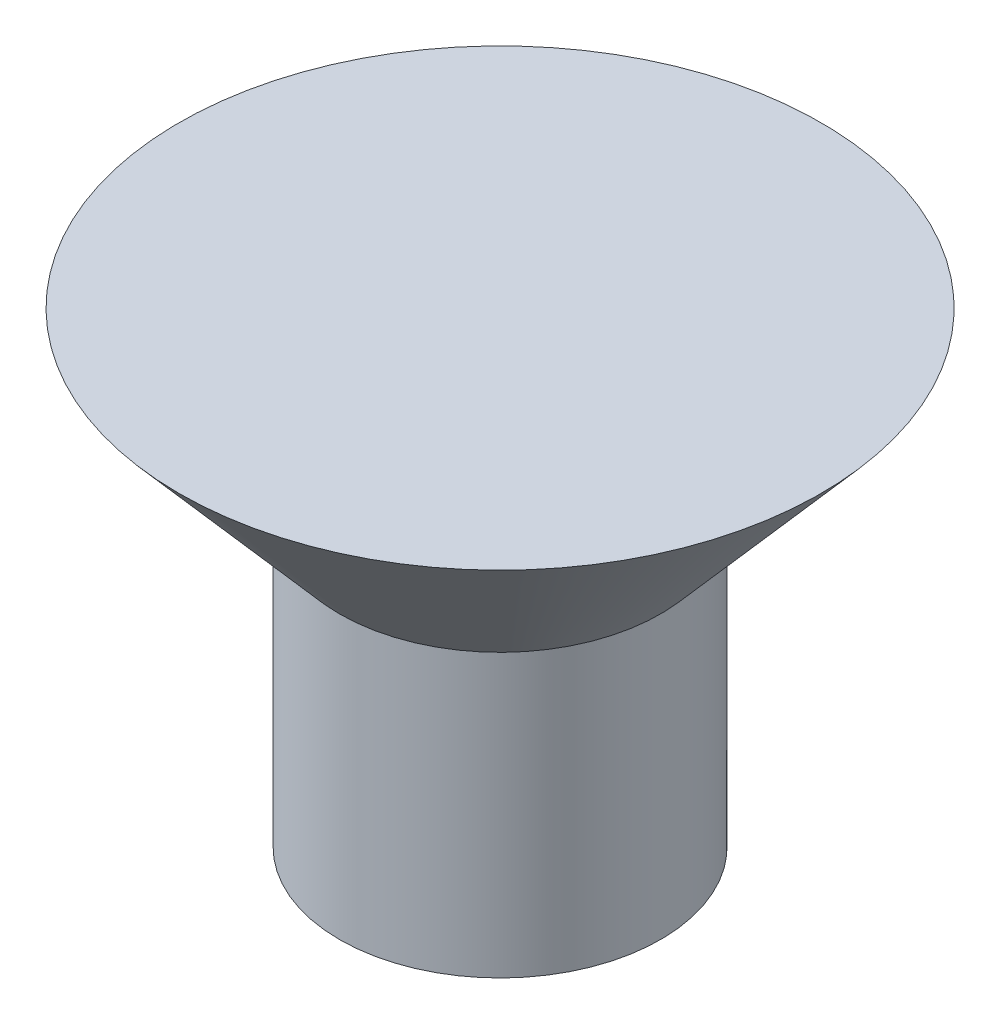
ISO-10303-21;
HEADER;
FILE_DESCRIPTION(('STEP AP214'),'2;1');
FILE_NAME('part.step','',(''),(''),'','','');
FILE_SCHEMA(('AUTOMOTIVE_DESIGN { 1 0 10303 214 1 1 1 1 }'));
ENDSEC;
DATA;
#1=APPLICATION_CONTEXT('core data for automotive mechanical design processes');
#2=APPLICATION_PROTOCOL_DEFINITION('international standard','automotive_design',2000,#1);
#3=PRODUCT_CONTEXT('',#1,'mechanical');
#4=PRODUCT('Part','Part','',(#3));
#5=PRODUCT_RELATED_PRODUCT_CATEGORY('part','',(#4));
#6=PRODUCT_DEFINITION_FORMATION('','',#4);
#7=PRODUCT_DEFINITION_CONTEXT('part definition',#1,'design');
#8=PRODUCT_DEFINITION('design','',#6,#7);
#9=PRODUCT_DEFINITION_SHAPE('','',#8);
#10=(LENGTH_UNIT() NAMED_UNIT(*) SI_UNIT(.MILLI.,.METRE.));
#11=(NAMED_UNIT(*) PLANE_ANGLE_UNIT() SI_UNIT($,.RADIAN.));
#12=(NAMED_UNIT(*) SI_UNIT($,.STERADIAN.) SOLID_ANGLE_UNIT());
#13=UNCERTAINTY_MEASURE_WITH_UNIT(LENGTH_MEASURE(1.E-05),#10,'distance_accuracy_value','');
#14=(GEOMETRIC_REPRESENTATION_CONTEXT(3) GLOBAL_UNCERTAINTY_ASSIGNED_CONTEXT((#13)) GLOBAL_UNIT_ASSIGNED_CONTEXT((#10,
#11,#12)) REPRESENTATION_CONTEXT('',''));
#15=CARTESIAN_POINT('',(0.,0.,0.));
#16=DIRECTION('',(0.,0.,1.));
#17=DIRECTION('',(1.,0.,0.));
#18=AXIS2_PLACEMENT_3D('',#15,#16,#17);
#19=CARTESIAN_POINT('',(0.,0.,0.));
#20=DIRECTION('',(0.,-1.,0.));
#21=DIRECTION('',(0.,0.,-1.));
#22=AXIS2_PLACEMENT_3D('',#19,#20,#21);
#23=PLANE('',#22);
#24=CARTESIAN_POINT('',(0.,0.,0.));
#25=DIRECTION('',(0.,1.,0.));
#26=DIRECTION('',(0.,0.,1.));
#27=AXIS2_PLACEMENT_3D('',#24,#25,#26);
#28=CIRCLE('',#27,2.1844);
#29=CARTESIAN_POINT('',(0.,0.,2.18439999999999));
#30=VERTEX_POINT('',#29);
#31=EDGE_CURVE('E10',#30,#30,#28,.T.);
#32=ORIENTED_EDGE('',*,*,#31,.T.);
#33=EDGE_LOOP('',(#32));
#34=FACE_BOUND('',#33,.T.);
#35=ADVANCED_FACE('F31',(#34),#23,.F.);
#36=CARTESIAN_POINT('',(0.,-1.25643237436678,0.));
#37=DIRECTION('',(0.,1.,0.));
#38=DIRECTION('',(0.,0.,1.));
#39=AXIS2_PLACEMENT_3D('',#36,#37,#38);
#40=CONICAL_SURFACE('',#39,1.0922,0.715584993317677);
#41=ORIENTED_EDGE('',*,*,#31,.F.);
#42=EDGE_LOOP('',(#41));
#43=FACE_BOUND('',#42,.T.);
#44=CARTESIAN_POINT('',(0.,-1.25643237436678,0.));
#45=DIRECTION('',(0.,1.,0.));
#46=DIRECTION('',(0.,0.,1.));
#47=AXIS2_PLACEMENT_3D('',#44,#45,#46);
#48=CIRCLE('',#47,1.0922);
#49=CARTESIAN_POINT('',(0.,-1.25643237436678,1.09219999999999));
#50=VERTEX_POINT('',#49);
#51=EDGE_CURVE('E37',#50,#50,#48,.T.);
#52=ORIENTED_EDGE('',*,*,#51,.T.);
#53=EDGE_LOOP('',(#52));
#54=FACE_BOUND('',#53,.T.);
#55=ADVANCED_FACE('F56',(#43,#54),#40,.T.);
#56=CARTESIAN_POINT('',(0.,42.9850411297935,0.));
#57=DIRECTION('',(0.,1.,0.));
#58=DIRECTION('',(0.,0.,1.));
#59=AXIS2_PLACEMENT_3D('',#56,#57,#58);
#60=CYLINDRICAL_SURFACE('',#59,1.0922);
#61=ORIENTED_EDGE('',*,*,#51,.F.);
#62=EDGE_LOOP('',(#61));
#63=FACE_BOUND('',#62,.T.);
#64=CARTESIAN_POINT('',(0.,-3.175,0.));
#65=DIRECTION('',(0.,1.,0.));
#66=DIRECTION('',(0.,0.,1.));
#67=AXIS2_PLACEMENT_3D('',#64,#65,#66);
#68=CIRCLE('',#67,1.0922);
#69=CARTESIAN_POINT('',(0.,-3.175,1.09219999999999));
#70=VERTEX_POINT('',#69);
#71=EDGE_CURVE('E41',#70,#70,#68,.T.);
#72=ORIENTED_EDGE('',*,*,#71,.T.);
#73=EDGE_LOOP('',(#72));
#74=FACE_BOUND('',#73,.T.);
#75=ADVANCED_FACE('F48',(#63,#74),#60,.T.);
#76=CARTESIAN_POINT('',(0.,-3.175,-1.09220000000001));
#77=DIRECTION('',(0.,1.,0.));
#78=DIRECTION('',(0.,0.,1.));
#79=AXIS2_PLACEMENT_3D('',#76,#77,#78);
#80=PLANE('',#79);
#81=ORIENTED_EDGE('',*,*,#71,.F.);
#82=EDGE_LOOP('',(#81));
#83=FACE_BOUND('',#82,.T.);
#84=ADVANCED_FACE('F50',(#83),#80,.F.);
#85=CLOSED_SHELL('',(#35,#55,#75,#84));
#86=MANIFOLD_SOLID_BREP('B2',#85);
#87=ADVANCED_BREP_SHAPE_REPRESENTATION('',(#18,#86),#14);
#88=SHAPE_DEFINITION_REPRESENTATION(#9,#87);
ENDSEC;
END-ISO-10303-21;
